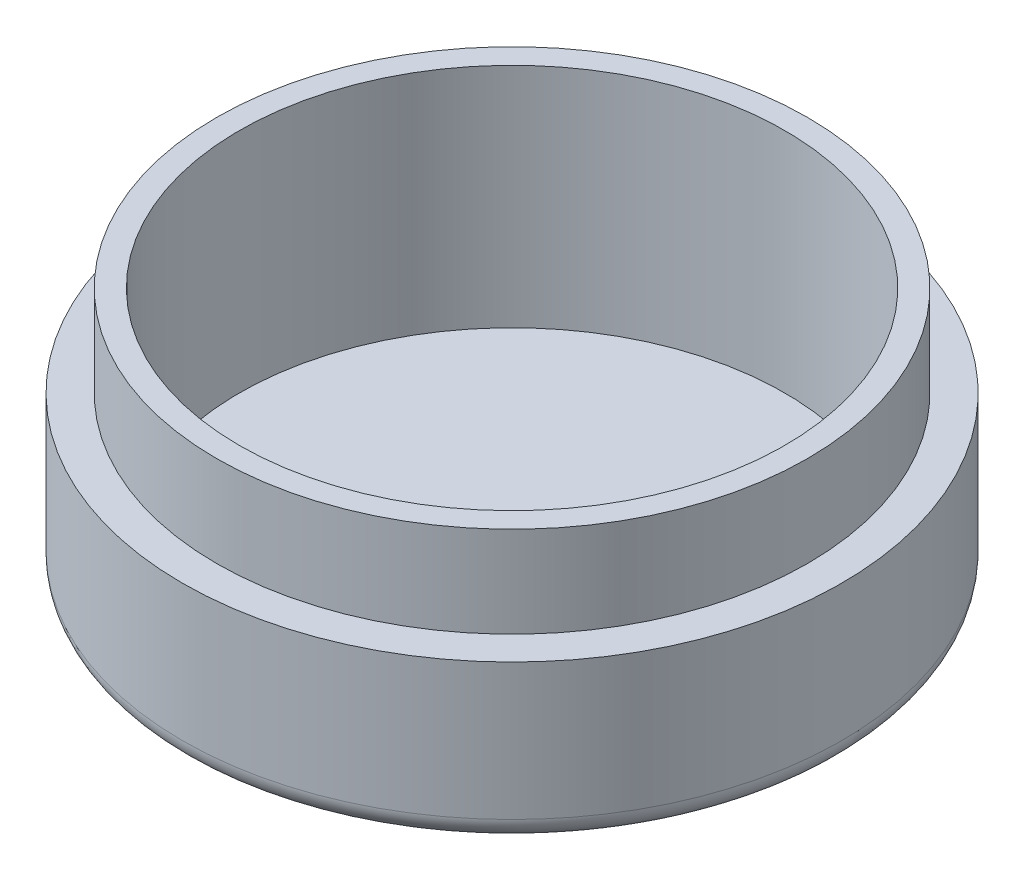
ISO-10303-21;
HEADER;
FILE_DESCRIPTION(('STEP AP214'),'2;1');
FILE_NAME('part.step','',(''),(''),'','','');
FILE_SCHEMA(('AUTOMOTIVE_DESIGN { 1 0 10303 214 1 1 1 1 }'));
ENDSEC;
DATA;
#1=APPLICATION_CONTEXT('core data for automotive mechanical design processes');
#2=APPLICATION_PROTOCOL_DEFINITION('international standard','automotive_design',2000,#1);
#3=PRODUCT_CONTEXT('',#1,'mechanical');
#4=PRODUCT('Part','Part','',(#3));
#5=PRODUCT_RELATED_PRODUCT_CATEGORY('part','',(#4));
#6=PRODUCT_DEFINITION_FORMATION('','',#4);
#7=PRODUCT_DEFINITION_CONTEXT('part definition',#1,'design');
#8=PRODUCT_DEFINITION('design','',#6,#7);
#9=PRODUCT_DEFINITION_SHAPE('','',#8);
#10=(LENGTH_UNIT() NAMED_UNIT(*) SI_UNIT(.MILLI.,.METRE.));
#11=(NAMED_UNIT(*) PLANE_ANGLE_UNIT() SI_UNIT($,.RADIAN.));
#12=(NAMED_UNIT(*) SI_UNIT($,.STERADIAN.) SOLID_ANGLE_UNIT());
#13=UNCERTAINTY_MEASURE_WITH_UNIT(LENGTH_MEASURE(1.E-05),#10,'distance_accuracy_value','');
#14=(GEOMETRIC_REPRESENTATION_CONTEXT(3) GLOBAL_UNCERTAINTY_ASSIGNED_CONTEXT((#13)) GLOBAL_UNIT_ASSIGNED_CONTEXT((#10,
#11,#12)) REPRESENTATION_CONTEXT('',''));
#15=CARTESIAN_POINT('',(0.,0.,0.));
#16=DIRECTION('',(0.,0.,1.));
#17=DIRECTION('',(1.,0.,0.));
#18=AXIS2_PLACEMENT_3D('',#15,#16,#17);
#19=CARTESIAN_POINT('',(0.,7.,0.));
#20=DIRECTION('',(0.,1.,0.));
#21=DIRECTION('',(0.,0.,1.));
#22=AXIS2_PLACEMENT_3D('',#19,#20,#21);
#23=PLANE('',#22);
#24=CARTESIAN_POINT('',(0.,7.,0.));
#25=DIRECTION('',(0.,1.,0.));
#26=DIRECTION('',(0.,0.,1.));
#27=AXIS2_PLACEMENT_3D('',#24,#25,#26);
#28=CIRCLE('',#27,14.5);
#29=CARTESIAN_POINT('',(0.,7.,14.5));
#30=VERTEX_POINT('',#29);
#31=EDGE_CURVE('E49',#30,#30,#28,.T.);
#32=ORIENTED_EDGE('',*,*,#31,.T.);
#33=EDGE_LOOP('',(#32));
#34=FACE_BOUND('',#33,.T.);
#35=CARTESIAN_POINT('',(0.,7.,0.));
#36=DIRECTION('',(0.,1.,0.));
#37=DIRECTION('',(0.,0.,1.));
#38=AXIS2_PLACEMENT_3D('',#35,#36,#37);
#39=CIRCLE('',#38,13.);
#40=CARTESIAN_POINT('',(0.,7.,13.));
#41=VERTEX_POINT('',#40);
#42=EDGE_CURVE('E55',#41,#41,#39,.T.);
#43=ORIENTED_EDGE('',*,*,#42,.F.);
#44=EDGE_LOOP('',(#43));
#45=FACE_BOUND('',#44,.T.);
#46=ADVANCED_FACE('F34',(#34,#45),#23,.T.);
#47=CARTESIAN_POINT('',(0.,1.,0.));
#48=DIRECTION('',(0.,-1.,0.));
#49=DIRECTION('',(0.,0.,-1.));
#50=AXIS2_PLACEMENT_3D('',#47,#48,#49);
#51=CYLINDRICAL_SURFACE('',#50,14.5);
#52=CARTESIAN_POINT('',(0.,1.,0.));
#53=DIRECTION('',(0.,1.,0.));
#54=DIRECTION('',(0.,0.,1.));
#55=AXIS2_PLACEMENT_3D('',#52,#53,#54);
#56=CIRCLE('',#55,14.5);
#57=CARTESIAN_POINT('',(0.,1.,14.5));
#58=VERTEX_POINT('',#57);
#59=EDGE_CURVE('E41',#58,#58,#56,.T.);
#60=ORIENTED_EDGE('',*,*,#59,.T.);
#61=EDGE_LOOP('',(#60));
#62=FACE_BOUND('',#61,.T.);
#63=ORIENTED_EDGE('',*,*,#31,.F.);
#64=EDGE_LOOP('',(#63));
#65=FACE_BOUND('',#64,.T.);
#66=ADVANCED_FACE('F79',(#62,#65),#51,.T.);
#67=CARTESIAN_POINT('',(0.,0.,0.));
#68=DIRECTION('',(0.,1.,0.));
#69=DIRECTION('',(0.,0.,1.));
#70=AXIS2_PLACEMENT_3D('',#67,#68,#69);
#71=PLANE('',#70);
#72=CARTESIAN_POINT('',(0.,0.,0.));
#73=DIRECTION('',(0.,1.,0.));
#74=DIRECTION('',(0.,0.,1.));
#75=AXIS2_PLACEMENT_3D('',#72,#73,#74);
#76=CIRCLE('',#75,13.5);
#77=CARTESIAN_POINT('',(0.,0.,13.5));
#78=VERTEX_POINT('',#77);
#79=EDGE_CURVE('E10',#78,#78,#76,.F.);
#80=ORIENTED_EDGE('',*,*,#79,.T.);
#81=EDGE_LOOP('',(#80));
#82=FACE_BOUND('',#81,.T.);
#83=ADVANCED_FACE('F69',(#82),#71,.F.);
#84=CARTESIAN_POINT('',(0.,11.,0.));
#85=DIRECTION('',(0.,1.,0.));
#86=DIRECTION('',(0.,0.,1.));
#87=AXIS2_PLACEMENT_3D('',#84,#85,#86);
#88=PLANE('',#87);
#89=CARTESIAN_POINT('',(0.,11.,0.));
#90=DIRECTION('',(0.,1.,0.));
#91=DIRECTION('',(0.,0.,1.));
#92=AXIS2_PLACEMENT_3D('',#89,#90,#91);
#93=CIRCLE('',#92,13.);
#94=CARTESIAN_POINT('',(0.,11.,13.));
#95=VERTEX_POINT('',#94);
#96=EDGE_CURVE('E54',#95,#95,#93,.T.);
#97=ORIENTED_EDGE('',*,*,#96,.T.);
#98=EDGE_LOOP('',(#97));
#99=FACE_BOUND('',#98,.T.);
#100=CARTESIAN_POINT('',(0.,11.,0.));
#101=DIRECTION('',(0.,1.,0.));
#102=DIRECTION('',(0.,0.,1.));
#103=AXIS2_PLACEMENT_3D('',#100,#101,#102);
#104=CIRCLE('',#103,12.);
#105=CARTESIAN_POINT('',(0.,11.,12.));
#106=VERTEX_POINT('',#105);
#107=EDGE_CURVE('E58',#106,#106,#104,.T.);
#108=ORIENTED_EDGE('',*,*,#107,.F.);
#109=EDGE_LOOP('',(#108));
#110=FACE_BOUND('',#109,.T.);
#111=ADVANCED_FACE('F66',(#99,#110),#88,.T.);
#112=CARTESIAN_POINT('',(0.,11.,0.));
#113=DIRECTION('',(0.,-1.,0.));
#114=DIRECTION('',(0.,0.,-1.));
#115=AXIS2_PLACEMENT_3D('',#112,#113,#114);
#116=CYLINDRICAL_SURFACE('',#115,13.);
#117=ORIENTED_EDGE('',*,*,#96,.F.);
#118=EDGE_LOOP('',(#117));
#119=FACE_BOUND('',#118,.T.);
#120=ORIENTED_EDGE('',*,*,#42,.T.);
#121=EDGE_LOOP('',(#120));
#122=FACE_BOUND('',#121,.T.);
#123=ADVANCED_FACE('F68',(#119,#122),#116,.T.);
#124=CARTESIAN_POINT('',(0.,1.,0.));
#125=DIRECTION('',(0.,1.,0.));
#126=DIRECTION('',(0.,0.,1.));
#127=AXIS2_PLACEMENT_3D('',#124,#125,#126);
#128=PLANE('',#127);
#129=CARTESIAN_POINT('',(0.,1.,0.));
#130=DIRECTION('',(0.,1.,0.));
#131=DIRECTION('',(0.,0.,1.));
#132=AXIS2_PLACEMENT_3D('',#129,#130,#131);
#133=CIRCLE('',#132,12.);
#134=CARTESIAN_POINT('',(0.,1.,12.));
#135=VERTEX_POINT('',#134);
#136=EDGE_CURVE('E45',#135,#135,#133,.F.);
#137=ORIENTED_EDGE('',*,*,#136,.F.);
#138=EDGE_LOOP('',(#137));
#139=FACE_BOUND('',#138,.T.);
#140=ADVANCED_FACE('F76',(#139),#128,.T.);
#141=CARTESIAN_POINT('',(0.,7.,0.));
#142=DIRECTION('',(0.,-1.,0.));
#143=DIRECTION('',(0.,0.,-1.));
#144=AXIS2_PLACEMENT_3D('',#141,#142,#143);
#145=CYLINDRICAL_SURFACE('',#144,12.);
#146=ORIENTED_EDGE('',*,*,#136,.T.);
#147=EDGE_LOOP('',(#146));
#148=FACE_BOUND('',#147,.T.);
#149=ORIENTED_EDGE('',*,*,#107,.T.);
#150=EDGE_LOOP('',(#149));
#151=FACE_BOUND('',#150,.T.);
#152=ADVANCED_FACE('F64',(#148,#151),#145,.F.);
#153=CARTESIAN_POINT('',(0.,1.,0.));
#154=DIRECTION('',(0.,1.,0.));
#155=DIRECTION('',(0.,0.,1.));
#156=AXIS2_PLACEMENT_3D('',#153,#154,#155);
#157=TOROIDAL_SURFACE('',#156,13.5,1.);
#158=ORIENTED_EDGE('',*,*,#79,.F.);
#159=EDGE_LOOP('',(#158));
#160=FACE_BOUND('',#159,.T.);
#161=ORIENTED_EDGE('',*,*,#59,.F.);
#162=EDGE_LOOP('',(#161));
#163=FACE_BOUND('',#162,.T.);
#164=ADVANCED_FACE('F36',(#160,#163),#157,.T.);
#165=CLOSED_SHELL('',(#46,#66,#83,#111,#123,#140,#152,#164));
#166=MANIFOLD_SOLID_BREP('B2',#165);
#167=ADVANCED_BREP_SHAPE_REPRESENTATION('',(#18,#166),#14);
#168=SHAPE_DEFINITION_REPRESENTATION(#9,#167);
ENDSEC;
END-ISO-10303-21;
